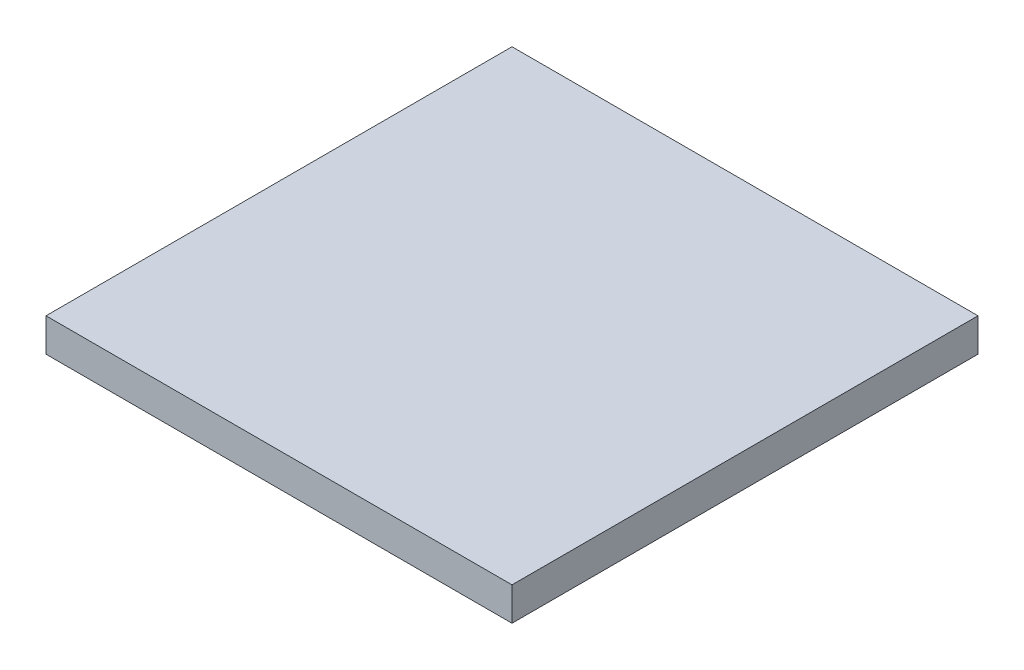
ISO-10303-21;
HEADER;
FILE_DESCRIPTION(('STEP AP214'),'2;1');
FILE_NAME('part.step','',(''),(''),'','','');
FILE_SCHEMA(('AUTOMOTIVE_DESIGN { 1 0 10303 214 1 1 1 1 }'));
ENDSEC;
DATA;
#1=APPLICATION_CONTEXT('core data for automotive mechanical design processes');
#2=APPLICATION_PROTOCOL_DEFINITION('international standard','automotive_design',2000,#1);
#3=PRODUCT_CONTEXT('',#1,'mechanical');
#4=PRODUCT('Part','Part','',(#3));
#5=PRODUCT_RELATED_PRODUCT_CATEGORY('part','',(#4));
#6=PRODUCT_DEFINITION_FORMATION('','',#4);
#7=PRODUCT_DEFINITION_CONTEXT('part definition',#1,'design');
#8=PRODUCT_DEFINITION('design','',#6,#7);
#9=PRODUCT_DEFINITION_SHAPE('','',#8);
#10=(LENGTH_UNIT() NAMED_UNIT(*) SI_UNIT(.MILLI.,.METRE.));
#11=(NAMED_UNIT(*) PLANE_ANGLE_UNIT() SI_UNIT($,.RADIAN.));
#12=(NAMED_UNIT(*) SI_UNIT($,.STERADIAN.) SOLID_ANGLE_UNIT());
#13=UNCERTAINTY_MEASURE_WITH_UNIT(LENGTH_MEASURE(1.E-05),#10,'distance_accuracy_value','');
#14=(GEOMETRIC_REPRESENTATION_CONTEXT(3) GLOBAL_UNCERTAINTY_ASSIGNED_CONTEXT((#13)) GLOBAL_UNIT_ASSIGNED_CONTEXT((#10,
#11,#12)) REPRESENTATION_CONTEXT('',''));
#15=CARTESIAN_POINT('',(0.,0.,0.));
#16=DIRECTION('',(0.,0.,1.));
#17=DIRECTION('',(1.,0.,0.));
#18=AXIS2_PLACEMENT_3D('',#15,#16,#17);
#19=CARTESIAN_POINT('',(0.,0.,0.));
#20=DIRECTION('',(0.,1.,0.));
#21=DIRECTION('',(0.,0.,1.));
#22=AXIS2_PLACEMENT_3D('',#19,#20,#21);
#23=PLANE('',#22);
#24=DIRECTION('',(-1.,0.,0.));
#25=VECTOR('',#24,1.);
#26=CARTESIAN_POINT('',(7.,0.,-7.));
#27=LINE('',#26,#25);
#28=CARTESIAN_POINT('',(7.,0.,-7.));
#29=VERTEX_POINT('',#28);
#30=CARTESIAN_POINT('',(-7.,0.,-7.));
#31=VERTEX_POINT('',#30);
#32=EDGE_CURVE('E20',#29,#31,#27,.T.);
#33=ORIENTED_EDGE('',*,*,#32,.F.);
#34=DIRECTION('',(0.,0.,-1.));
#35=VECTOR('',#34,1.);
#36=CARTESIAN_POINT('',(7.,0.,7.));
#37=LINE('',#36,#35);
#38=CARTESIAN_POINT('',(7.,0.,7.));
#39=VERTEX_POINT('',#38);
#40=EDGE_CURVE('E80',#39,#29,#37,.T.);
#41=ORIENTED_EDGE('',*,*,#40,.F.);
#42=DIRECTION('',(1.,0.,0.));
#43=VECTOR('',#42,1.);
#44=CARTESIAN_POINT('',(-7.,0.,7.));
#45=LINE('',#44,#43);
#46=CARTESIAN_POINT('',(-7.,0.,7.));
#47=VERTEX_POINT('',#46);
#48=EDGE_CURVE('E68',#47,#39,#45,.T.);
#49=ORIENTED_EDGE('',*,*,#48,.F.);
#50=DIRECTION('',(0.,0.,1.));
#51=VECTOR('',#50,1.);
#52=CARTESIAN_POINT('',(-7.,0.,-7.));
#53=LINE('',#52,#51);
#54=EDGE_CURVE('E55',#31,#47,#53,.T.);
#55=ORIENTED_EDGE('',*,*,#54,.F.);
#56=EDGE_LOOP('',(#33,#41,#49,#55));
#57=FACE_BOUND('',#56,.T.);
#58=ADVANCED_FACE('F17',(#57),#23,.F.);
#59=CARTESIAN_POINT('',(7.,0.,-7.));
#60=DIRECTION('',(0.,0.,-1.));
#61=DIRECTION('',(-1.,0.,0.));
#62=AXIS2_PLACEMENT_3D('',#59,#60,#61);
#63=PLANE('',#62);
#64=ORIENTED_EDGE('',*,*,#32,.T.);
#65=DIRECTION('',(0.,1.,0.));
#66=VECTOR('',#65,1.);
#67=CARTESIAN_POINT('',(-7.,0.,-7.));
#68=LINE('',#67,#66);
#69=CARTESIAN_POINT('',(-7.,1.,-7.));
#70=VERTEX_POINT('',#69);
#71=EDGE_CURVE('E61',#70,#31,#68,.F.);
#72=ORIENTED_EDGE('',*,*,#71,.F.);
#73=DIRECTION('',(1.,0.,0.));
#74=VECTOR('',#73,1.);
#75=CARTESIAN_POINT('',(0.,1.,-7.));
#76=LINE('',#75,#74);
#77=CARTESIAN_POINT('',(7.,1.,-7.));
#78=VERTEX_POINT('',#77);
#79=EDGE_CURVE('E83',#78,#70,#76,.F.);
#80=ORIENTED_EDGE('',*,*,#79,.F.);
#81=DIRECTION('',(0.,1.,0.));
#82=VECTOR('',#81,1.);
#83=CARTESIAN_POINT('',(7.,0.,-7.));
#84=LINE('',#83,#82);
#85=EDGE_CURVE('E64',#29,#78,#84,.T.);
#86=ORIENTED_EDGE('',*,*,#85,.F.);
#87=EDGE_LOOP('',(#64,#72,#80,#86));
#88=FACE_BOUND('',#87,.T.);
#89=ADVANCED_FACE('F60',(#88),#63,.T.);
#90=CARTESIAN_POINT('',(-7.,0.,-7.));
#91=DIRECTION('',(-1.,0.,0.));
#92=DIRECTION('',(0.,0.,1.));
#93=AXIS2_PLACEMENT_3D('',#90,#91,#92);
#94=PLANE('',#93);
#95=ORIENTED_EDGE('',*,*,#54,.T.);
#96=DIRECTION('',(0.,1.,0.));
#97=VECTOR('',#96,1.);
#98=CARTESIAN_POINT('',(-7.,0.,7.));
#99=LINE('',#98,#97);
#100=CARTESIAN_POINT('',(-7.,1.,7.));
#101=VERTEX_POINT('',#100);
#102=EDGE_CURVE('E70',#101,#47,#99,.F.);
#103=ORIENTED_EDGE('',*,*,#102,.F.);
#104=DIRECTION('',(0.,0.,1.));
#105=VECTOR('',#104,1.);
#106=CARTESIAN_POINT('',(-7.,1.,0.));
#107=LINE('',#106,#105);
#108=EDGE_CURVE('E74',#70,#101,#107,.T.);
#109=ORIENTED_EDGE('',*,*,#108,.F.);
#110=ORIENTED_EDGE('',*,*,#71,.T.);
#111=EDGE_LOOP('',(#95,#103,#109,#110));
#112=FACE_BOUND('',#111,.T.);
#113=ADVANCED_FACE('F72',(#112),#94,.T.);
#114=CARTESIAN_POINT('',(-7.,0.,7.));
#115=DIRECTION('',(0.,0.,1.));
#116=DIRECTION('',(1.,0.,0.));
#117=AXIS2_PLACEMENT_3D('',#114,#115,#116);
#118=PLANE('',#117);
#119=ORIENTED_EDGE('',*,*,#48,.T.);
#120=DIRECTION('',(0.,1.,0.));
#121=VECTOR('',#120,1.);
#122=CARTESIAN_POINT('',(7.,0.,7.));
#123=LINE('',#122,#121);
#124=CARTESIAN_POINT('',(7.,1.,7.));
#125=VERTEX_POINT('',#124);
#126=EDGE_CURVE('E35',#125,#39,#123,.F.);
#127=ORIENTED_EDGE('',*,*,#126,.F.);
#128=DIRECTION('',(1.,0.,0.));
#129=VECTOR('',#128,1.);
#130=CARTESIAN_POINT('',(0.,1.,7.));
#131=LINE('',#130,#129);
#132=EDGE_CURVE('E26',#101,#125,#131,.T.);
#133=ORIENTED_EDGE('',*,*,#132,.F.);
#134=ORIENTED_EDGE('',*,*,#102,.T.);
#135=EDGE_LOOP('',(#119,#127,#133,#134));
#136=FACE_BOUND('',#135,.T.);
#137=ADVANCED_FACE('F89',(#136),#118,.T.);
#138=CARTESIAN_POINT('',(7.,0.,7.));
#139=DIRECTION('',(1.,0.,0.));
#140=DIRECTION('',(0.,0.,-1.));
#141=AXIS2_PLACEMENT_3D('',#138,#139,#140);
#142=PLANE('',#141);
#143=ORIENTED_EDGE('',*,*,#40,.T.);
#144=ORIENTED_EDGE('',*,*,#85,.T.);
#145=DIRECTION('',(0.,0.,1.));
#146=VECTOR('',#145,1.);
#147=CARTESIAN_POINT('',(7.,1.,0.));
#148=LINE('',#147,#146);
#149=EDGE_CURVE('E11',#125,#78,#148,.F.);
#150=ORIENTED_EDGE('',*,*,#149,.F.);
#151=ORIENTED_EDGE('',*,*,#126,.T.);
#152=EDGE_LOOP('',(#143,#144,#150,#151));
#153=FACE_BOUND('',#152,.T.);
#154=ADVANCED_FACE('F91',(#153),#142,.T.);
#155=CARTESIAN_POINT('',(0.,1.,0.));
#156=DIRECTION('',(0.,1.,0.));
#157=DIRECTION('',(0.,0.,1.));
#158=AXIS2_PLACEMENT_3D('',#155,#156,#157);
#159=PLANE('',#158);
#160=ORIENTED_EDGE('',*,*,#132,.T.);
#161=ORIENTED_EDGE('',*,*,#149,.T.);
#162=ORIENTED_EDGE('',*,*,#79,.T.);
#163=ORIENTED_EDGE('',*,*,#108,.T.);
#164=EDGE_LOOP('',(#160,#161,#162,#163));
#165=FACE_BOUND('',#164,.T.);
#166=ADVANCED_FACE('F88',(#165),#159,.T.);
#167=CLOSED_SHELL('',(#58,#89,#113,#137,#154,#166));
#168=MANIFOLD_SOLID_BREP('B1',#167);
#169=ADVANCED_BREP_SHAPE_REPRESENTATION('',(#18,#168),#14);
#170=SHAPE_DEFINITION_REPRESENTATION(#9,#169);
ENDSEC;
END-ISO-10303-21;
